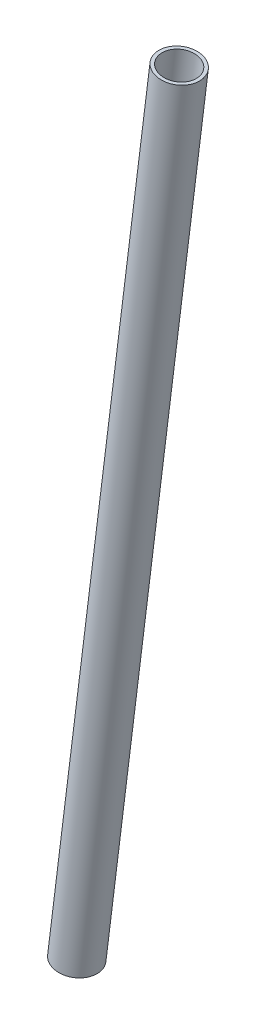
ISO-10303-21;
HEADER;
FILE_DESCRIPTION(('STEP AP214'),'2;1');
FILE_NAME('part.step','',(''),(''),'','','');
FILE_SCHEMA(('AUTOMOTIVE_DESIGN { 1 0 10303 214 1 1 1 1 }'));
ENDSEC;
DATA;
#1=APPLICATION_CONTEXT('core data for automotive mechanical design processes');
#2=APPLICATION_PROTOCOL_DEFINITION('international standard','automotive_design',2000,#1);
#3=PRODUCT_CONTEXT('',#1,'mechanical');
#4=PRODUCT('Part','Part','',(#3));
#5=PRODUCT_RELATED_PRODUCT_CATEGORY('part','',(#4));
#6=PRODUCT_DEFINITION_FORMATION('','',#4);
#7=PRODUCT_DEFINITION_CONTEXT('part definition',#1,'design');
#8=PRODUCT_DEFINITION('design','',#6,#7);
#9=PRODUCT_DEFINITION_SHAPE('','',#8);
#10=(LENGTH_UNIT() NAMED_UNIT(*) SI_UNIT(.MILLI.,.METRE.));
#11=(NAMED_UNIT(*) PLANE_ANGLE_UNIT() SI_UNIT($,.RADIAN.));
#12=(NAMED_UNIT(*) SI_UNIT($,.STERADIAN.) SOLID_ANGLE_UNIT());
#13=UNCERTAINTY_MEASURE_WITH_UNIT(LENGTH_MEASURE(1.E-05),#10,'distance_accuracy_value','');
#14=(GEOMETRIC_REPRESENTATION_CONTEXT(3) GLOBAL_UNCERTAINTY_ASSIGNED_CONTEXT((#13)) GLOBAL_UNIT_ASSIGNED_CONTEXT((#10,
#11,#12)) REPRESENTATION_CONTEXT('',''));
#15=CARTESIAN_POINT('',(0.,0.,0.));
#16=DIRECTION('',(0.,0.,1.));
#17=DIRECTION('',(1.,0.,0.));
#18=AXIS2_PLACEMENT_3D('',#15,#16,#17);
#19=CARTESIAN_POINT('',(573.972771974131,224.054469540869,43.8548815301759));
#20=DIRECTION('',(0.139837572452379,0.989988079570085,0.0192108209028285));
#21=DIRECTION('',(-0.990170810492079,0.13986338351927,0.));
#22=AXIS2_PLACEMENT_3D('',#19,#20,#21);
#23=PLANE('',#22);
#24=CARTESIAN_POINT('',(573.972771974131,224.054469540869,43.8548815301759));
#25=DIRECTION('',(0.139837572452379,0.989988079570085,0.0192108209028285));
#26=DIRECTION('',(-0.990170810492079,0.13986338351927,0.));
#27=AXIS2_PLACEMENT_3D('',#24,#25,#26);
#28=CIRCLE('',#27,5.34999999999997);
#29=CARTESIAN_POINT('',(568.675358137998,224.802738642697,43.8548815301759));
#30=VERTEX_POINT('',#29);
#31=EDGE_CURVE('E57',#30,#30,#28,.T.);
#32=ORIENTED_EDGE('',*,*,#31,.T.);
#33=EDGE_LOOP('',(#32));
#34=FACE_BOUND('',#33,.T.);
#35=CARTESIAN_POINT('',(573.972771974131,224.054469540869,43.8548815301759));
#36=DIRECTION('',(0.139837572452379,0.989988079570085,0.0192108209028285));
#37=DIRECTION('',(-0.990170810492079,0.13986338351927,0.));
#38=AXIS2_PLACEMENT_3D('',#35,#36,#37);
#39=CIRCLE('',#38,6.34999999999997);
#40=CARTESIAN_POINT('',(567.685187327506,224.942602026216,43.8548815301759));
#41=VERTEX_POINT('',#40);
#42=EDGE_CURVE('E49',#41,#41,#39,.T.);
#43=ORIENTED_EDGE('',*,*,#42,.F.);
#44=EDGE_LOOP('',(#43));
#45=FACE_BOUND('',#44,.T.);
#46=ADVANCED_FACE('F43',(#34,#45),#23,.F.);
#47=CARTESIAN_POINT('',(610.297228025869,481.215530459131,48.8451184698241));
#48=DIRECTION('',(0.139837572452379,0.989988079570085,0.0192108209028285));
#49=DIRECTION('',(-0.990170810492079,0.13986338351927,0.));
#50=AXIS2_PLACEMENT_3D('',#47,#48,#49);
#51=PLANE('',#50);
#52=CARTESIAN_POINT('',(610.297228025869,481.215530459131,48.8451184698241));
#53=DIRECTION('',(0.139837572452379,0.989988079570085,0.0192108209028285));
#54=DIRECTION('',(-0.990170810492079,0.13986338351927,0.));
#55=AXIS2_PLACEMENT_3D('',#52,#53,#54);
#56=CIRCLE('',#55,5.34999999999997);
#57=CARTESIAN_POINT('',(604.999814189737,481.963799560959,48.8451184698241));
#58=VERTEX_POINT('',#57);
#59=EDGE_CURVE('E53',#58,#58,#56,.T.);
#60=ORIENTED_EDGE('',*,*,#59,.F.);
#61=EDGE_LOOP('',(#60));
#62=FACE_BOUND('',#61,.T.);
#63=CARTESIAN_POINT('',(610.297228025869,481.215530459131,48.8451184698241));
#64=DIRECTION('',(0.139837572452379,0.989988079570085,0.0192108209028285));
#65=DIRECTION('',(-0.990170810492079,0.13986338351927,0.));
#66=AXIS2_PLACEMENT_3D('',#63,#64,#65);
#67=CIRCLE('',#66,6.34999999999997);
#68=CARTESIAN_POINT('',(604.009643379244,482.103662944479,48.8451184698241));
#69=VERTEX_POINT('',#68);
#70=EDGE_CURVE('E11',#69,#69,#67,.T.);
#71=ORIENTED_EDGE('',*,*,#70,.T.);
#72=EDGE_LOOP('',(#71));
#73=FACE_BOUND('',#72,.T.);
#74=ADVANCED_FACE('F73',(#62,#73),#51,.T.);
#75=CARTESIAN_POINT('',(573.972771974131,224.054469540869,43.8548815301759));
#76=DIRECTION('',(0.139837572452379,0.989988079570085,0.0192108209028284));
#77=DIRECTION('',(-0.990170810492079,0.139863383519271,0.));
#78=AXIS2_PLACEMENT_3D('',#75,#76,#77);
#79=CYLINDRICAL_SURFACE('',#78,6.34999999999997);
#80=ORIENTED_EDGE('',*,*,#70,.F.);
#81=EDGE_LOOP('',(#80));
#82=FACE_BOUND('',#81,.T.);
#83=ORIENTED_EDGE('',*,*,#42,.T.);
#84=EDGE_LOOP('',(#83));
#85=FACE_BOUND('',#84,.T.);
#86=ADVANCED_FACE('F67',(#82,#85),#79,.T.);
#87=CARTESIAN_POINT('',(573.972771974131,224.054469540869,43.8548815301759));
#88=DIRECTION('',(0.139837572452379,0.989988079570085,0.0192108209028284));
#89=DIRECTION('',(-0.990170810492079,0.139863383519271,0.));
#90=AXIS2_PLACEMENT_3D('',#87,#88,#89);
#91=CYLINDRICAL_SURFACE('',#90,5.34999999999997);
#92=ORIENTED_EDGE('',*,*,#59,.T.);
#93=EDGE_LOOP('',(#92));
#94=FACE_BOUND('',#93,.T.);
#95=ORIENTED_EDGE('',*,*,#31,.F.);
#96=EDGE_LOOP('',(#95));
#97=FACE_BOUND('',#96,.T.);
#98=ADVANCED_FACE('F65',(#94,#97),#91,.F.);
#99=CLOSED_SHELL('',(#46,#74,#86,#98));
#100=MANIFOLD_SOLID_BREP('B2',#99);
#101=ADVANCED_BREP_SHAPE_REPRESENTATION('',(#18,#100),#14);
#102=SHAPE_DEFINITION_REPRESENTATION(#9,#101);
ENDSEC;
END-ISO-10303-21;
